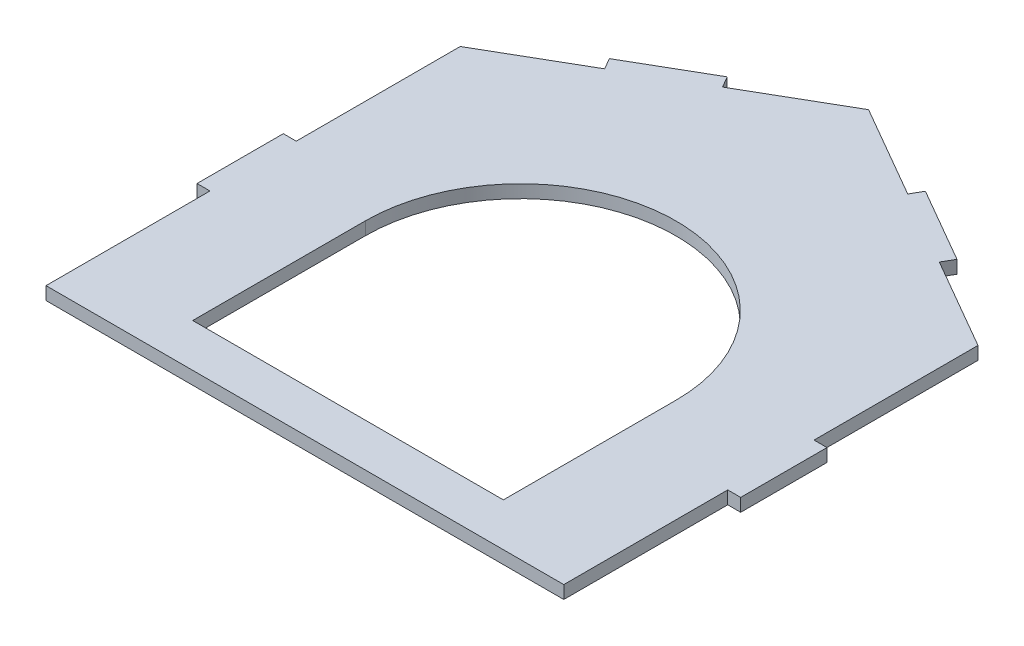
ISO-10303-21;
HEADER;
FILE_DESCRIPTION(('STEP AP214'),'2;1');
FILE_NAME('part.step','',(''),(''),'','','');
FILE_SCHEMA(('AUTOMOTIVE_DESIGN { 1 0 10303 214 1 1 1 1 }'));
ENDSEC;
DATA;
#1=APPLICATION_CONTEXT('core data for automotive mechanical design processes');
#2=APPLICATION_PROTOCOL_DEFINITION('international standard','automotive_design',2000,#1);
#3=PRODUCT_CONTEXT('',#1,'mechanical');
#4=PRODUCT('Part','Part','',(#3));
#5=PRODUCT_RELATED_PRODUCT_CATEGORY('part','',(#4));
#6=PRODUCT_DEFINITION_FORMATION('','',#4);
#7=PRODUCT_DEFINITION_CONTEXT('part definition',#1,'design');
#8=PRODUCT_DEFINITION('design','',#6,#7);
#9=PRODUCT_DEFINITION_SHAPE('','',#8);
#10=(LENGTH_UNIT() NAMED_UNIT(*) SI_UNIT(.MILLI.,.METRE.));
#11=(NAMED_UNIT(*) PLANE_ANGLE_UNIT() SI_UNIT($,.RADIAN.));
#12=(NAMED_UNIT(*) SI_UNIT($,.STERADIAN.) SOLID_ANGLE_UNIT());
#13=UNCERTAINTY_MEASURE_WITH_UNIT(LENGTH_MEASURE(1.E-05),#10,'distance_accuracy_value','');
#14=(GEOMETRIC_REPRESENTATION_CONTEXT(3) GLOBAL_UNCERTAINTY_ASSIGNED_CONTEXT((#13)) GLOBAL_UNIT_ASSIGNED_CONTEXT((#10,
#11,#12)) REPRESENTATION_CONTEXT('',''));
#15=CARTESIAN_POINT('',(0.,0.,0.));
#16=DIRECTION('',(0.,0.,1.));
#17=DIRECTION('',(1.,0.,0.));
#18=AXIS2_PLACEMENT_3D('',#15,#16,#17);
#19=CARTESIAN_POINT('',(193.911888036406,15.,-301.25));
#20=DIRECTION('',(-0.5,0.,0.866025403784439));
#21=DIRECTION('',(0.866025403784439,0.,0.5));
#22=AXIS2_PLACEMENT_3D('',#19,#20,#21);
#23=PLANE('',#22);
#24=DIRECTION('',(-0.866025403784439,0.,-0.5));
#25=VECTOR('',#24,1.);
#26=CARTESIAN_POINT('',(193.911888036406,0.,-301.25));
#27=LINE('',#26,#25);
#28=CARTESIAN_POINT('',(300.,0.,-240.));
#29=VERTEX_POINT('',#28);
#30=CARTESIAN_POINT('',(193.911888036406,0.,-301.25));
#31=VERTEX_POINT('',#30);
#32=EDGE_CURVE('E205',#29,#31,#27,.T.);
#33=ORIENTED_EDGE('',*,*,#32,.T.);
#34=DIRECTION('',(0.,-1.,0.));
#35=VECTOR('',#34,1.);
#36=CARTESIAN_POINT('',(193.911888036406,15.,-301.25));
#37=LINE('',#36,#35);
#38=CARTESIAN_POINT('',(193.911888036406,15.,-301.25));
#39=VERTEX_POINT('',#38);
#40=EDGE_CURVE('E11',#39,#31,#37,.T.);
#41=ORIENTED_EDGE('',*,*,#40,.F.);
#42=DIRECTION('',(-0.866025403784439,0.,-0.5));
#43=VECTOR('',#42,1.);
#44=CARTESIAN_POINT('',(193.911888036406,15.,-301.25));
#45=LINE('',#44,#43);
#46=CARTESIAN_POINT('',(300.,15.,-240.));
#47=VERTEX_POINT('',#46);
#48=EDGE_CURVE('E234',#47,#39,#45,.T.);
#49=ORIENTED_EDGE('',*,*,#48,.F.);
#50=DIRECTION('',(0.,-1.,0.));
#51=VECTOR('',#50,1.);
#52=CARTESIAN_POINT('',(300.,15.,-240.));
#53=LINE('',#52,#51);
#54=EDGE_CURVE('E278',#47,#29,#53,.T.);
#55=ORIENTED_EDGE('',*,*,#54,.T.);
#56=EDGE_LOOP('',(#33,#41,#49,#55));
#57=FACE_BOUND('',#56,.T.);
#58=ADVANCED_FACE('F33',(#57),#23,.F.);
#59=CARTESIAN_POINT('',(193.911888036406,15.,-301.25));
#60=DIRECTION('',(-0.866025403784439,0.,-0.5));
#61=DIRECTION('',(-0.5,0.,0.866025403784439));
#62=AXIS2_PLACEMENT_3D('',#59,#60,#61);
#63=PLANE('',#62);
#64=DIRECTION('',(0.5,0.,-0.866025403784439));
#65=VECTOR('',#64,1.);
#66=CARTESIAN_POINT('',(193.911888036406,0.,-301.25));
#67=LINE('',#66,#65);
#68=CARTESIAN_POINT('',(201.411888036406,0.,-314.240381056767));
#69=VERTEX_POINT('',#68);
#70=EDGE_CURVE('E281',#31,#69,#67,.T.);
#71=ORIENTED_EDGE('',*,*,#70,.T.);
#72=DIRECTION('',(0.,-1.,0.));
#73=VECTOR('',#72,1.);
#74=CARTESIAN_POINT('',(201.411888036406,15.,-314.240381056767));
#75=LINE('',#74,#73);
#76=CARTESIAN_POINT('',(201.411888036406,15.,-314.240381056767));
#77=VERTEX_POINT('',#76);
#78=EDGE_CURVE('E40',#77,#69,#75,.T.);
#79=ORIENTED_EDGE('',*,*,#78,.F.);
#80=DIRECTION('',(0.5,0.,-0.866025403784439));
#81=VECTOR('',#80,1.);
#82=CARTESIAN_POINT('',(193.911888036406,15.,-301.25));
#83=LINE('',#82,#81);
#84=EDGE_CURVE('E237',#39,#77,#83,.T.);
#85=ORIENTED_EDGE('',*,*,#84,.F.);
#86=ORIENTED_EDGE('',*,*,#40,.T.);
#87=EDGE_LOOP('',(#71,#79,#85,#86));
#88=FACE_BOUND('',#87,.T.);
#89=ADVANCED_FACE('F401',(#88),#63,.F.);
#90=CARTESIAN_POINT('',(201.411888036406,15.,-314.240381056767));
#91=DIRECTION('',(-0.500000000000003,0.,0.866025403784437));
#92=DIRECTION('',(0.866025403784437,0.,0.500000000000003));
#93=AXIS2_PLACEMENT_3D('',#90,#91,#92);
#94=PLANE('',#93);
#95=DIRECTION('',(-0.866025403784437,0.,-0.500000000000003));
#96=VECTOR('',#95,1.);
#97=CARTESIAN_POINT('',(201.411888036406,0.,-314.240381056767));
#98=LINE('',#97,#96);
#99=CARTESIAN_POINT('',(114.809347657962,0.,-364.240381056767));
#100=VERTEX_POINT('',#99);
#101=EDGE_CURVE('E283',#69,#100,#98,.T.);
#102=ORIENTED_EDGE('',*,*,#101,.T.);
#103=DIRECTION('',(0.,-1.,0.));
#104=VECTOR('',#103,1.);
#105=CARTESIAN_POINT('',(114.809347657962,15.,-364.240381056767));
#106=LINE('',#105,#104);
#107=CARTESIAN_POINT('',(114.809347657962,15.,-364.240381056767));
#108=VERTEX_POINT('',#107);
#109=EDGE_CURVE('E373',#108,#100,#106,.T.);
#110=ORIENTED_EDGE('',*,*,#109,.F.);
#111=DIRECTION('',(-0.866025403784437,0.,-0.500000000000003));
#112=VECTOR('',#111,1.);
#113=CARTESIAN_POINT('',(201.411888036406,15.,-314.240381056767));
#114=LINE('',#113,#112);
#115=EDGE_CURVE('E240',#77,#108,#114,.T.);
#116=ORIENTED_EDGE('',*,*,#115,.F.);
#117=ORIENTED_EDGE('',*,*,#78,.T.);
#118=EDGE_LOOP('',(#102,#110,#116,#117));
#119=FACE_BOUND('',#118,.T.);
#120=ADVANCED_FACE('F380',(#119),#94,.F.);
#121=CARTESIAN_POINT('',(114.809347657962,15.,-364.240381056767));
#122=DIRECTION('',(0.866025403784441,0.,0.499999999999995));
#123=DIRECTION('',(0.499999999999995,0.,-0.866025403784441));
#124=AXIS2_PLACEMENT_3D('',#121,#122,#123);
#125=PLANE('',#124);
#126=DIRECTION('',(-0.499999999999995,0.,0.866025403784441));
#127=VECTOR('',#126,1.);
#128=CARTESIAN_POINT('',(114.809347657962,0.,-364.240381056767));
#129=LINE('',#128,#127);
#130=CARTESIAN_POINT('',(107.309347657962,0.,-351.25));
#131=VERTEX_POINT('',#130);
#132=EDGE_CURVE('E285',#100,#131,#129,.T.);
#133=ORIENTED_EDGE('',*,*,#132,.T.);
#134=DIRECTION('',(0.,-1.,0.));
#135=VECTOR('',#134,1.);
#136=CARTESIAN_POINT('',(107.309347657962,15.,-351.25));
#137=LINE('',#136,#135);
#138=CARTESIAN_POINT('',(107.309347657962,15.,-351.25));
#139=VERTEX_POINT('',#138);
#140=EDGE_CURVE('E370',#139,#131,#137,.T.);
#141=ORIENTED_EDGE('',*,*,#140,.F.);
#142=DIRECTION('',(-0.499999999999995,0.,0.866025403784441));
#143=VECTOR('',#142,1.);
#144=CARTESIAN_POINT('',(114.809347657962,15.,-364.240381056767));
#145=LINE('',#144,#143);
#146=EDGE_CURVE('E242',#108,#139,#145,.T.);
#147=ORIENTED_EDGE('',*,*,#146,.F.);
#148=ORIENTED_EDGE('',*,*,#109,.T.);
#149=EDGE_LOOP('',(#133,#141,#147,#148));
#150=FACE_BOUND('',#149,.T.);
#151=ADVANCED_FACE('F389',(#150),#125,.F.);
#152=CARTESIAN_POINT('',(0.,15.,-413.205080756888));
#153=DIRECTION('',(-0.500000000000003,0.,0.866025403784437));
#154=DIRECTION('',(0.866025403784437,0.,0.500000000000003));
#155=AXIS2_PLACEMENT_3D('',#152,#153,#154);
#156=PLANE('',#155);
#157=DIRECTION('',(-0.866025403784437,0.,-0.500000000000003));
#158=VECTOR('',#157,1.);
#159=CARTESIAN_POINT('',(0.,0.,-413.205080756888));
#160=LINE('',#159,#158);
#161=CARTESIAN_POINT('',(0.,0.,-413.205080756888));
#162=VERTEX_POINT('',#161);
#163=EDGE_CURVE('E287',#131,#162,#160,.T.);
#164=ORIENTED_EDGE('',*,*,#163,.T.);
#165=DIRECTION('',(0.,-1.,0.));
#166=VECTOR('',#165,1.);
#167=CARTESIAN_POINT('',(0.,15.,-413.205080756888));
#168=LINE('',#167,#166);
#169=CARTESIAN_POINT('',(0.,15.,-413.205080756888));
#170=VERTEX_POINT('',#169);
#171=EDGE_CURVE('E367',#170,#162,#168,.T.);
#172=ORIENTED_EDGE('',*,*,#171,.F.);
#173=DIRECTION('',(-0.866025403784437,0.,-0.500000000000003));
#174=VECTOR('',#173,1.);
#175=CARTESIAN_POINT('',(0.,15.,-413.205080756888));
#176=LINE('',#175,#174);
#177=EDGE_CURVE('E244',#139,#170,#176,.T.);
#178=ORIENTED_EDGE('',*,*,#177,.F.);
#179=ORIENTED_EDGE('',*,*,#140,.T.);
#180=EDGE_LOOP('',(#164,#172,#178,#179));
#181=FACE_BOUND('',#180,.T.);
#182=ADVANCED_FACE('F393',(#181),#156,.F.);
#183=CARTESIAN_POINT('',(-107.309347657962,15.,-351.25));
#184=DIRECTION('',(0.500000000000003,0.,0.866025403784437));
#185=DIRECTION('',(0.866025403784437,0.,-0.500000000000003));
#186=AXIS2_PLACEMENT_3D('',#183,#184,#185);
#187=PLANE('',#186);
#188=DIRECTION('',(-0.866025403784437,0.,0.500000000000003));
#189=VECTOR('',#188,1.);
#190=CARTESIAN_POINT('',(-107.309347657962,0.,-351.25));
#191=LINE('',#190,#189);
#192=CARTESIAN_POINT('',(-107.309347657962,0.,-351.25));
#193=VERTEX_POINT('',#192);
#194=EDGE_CURVE('E289',#162,#193,#191,.T.);
#195=ORIENTED_EDGE('',*,*,#194,.T.);
#196=DIRECTION('',(0.,-1.,0.));
#197=VECTOR('',#196,1.);
#198=CARTESIAN_POINT('',(-107.309347657962,15.,-351.25));
#199=LINE('',#198,#197);
#200=CARTESIAN_POINT('',(-107.309347657962,15.,-351.25));
#201=VERTEX_POINT('',#200);
#202=EDGE_CURVE('E364',#201,#193,#199,.T.);
#203=ORIENTED_EDGE('',*,*,#202,.F.);
#204=DIRECTION('',(-0.866025403784437,0.,0.500000000000003));
#205=VECTOR('',#204,1.);
#206=CARTESIAN_POINT('',(-107.309347657962,15.,-351.25));
#207=LINE('',#206,#205);
#208=EDGE_CURVE('E246',#170,#201,#207,.T.);
#209=ORIENTED_EDGE('',*,*,#208,.F.);
#210=ORIENTED_EDGE('',*,*,#171,.T.);
#211=EDGE_LOOP('',(#195,#203,#209,#210));
#212=FACE_BOUND('',#211,.T.);
#213=ADVANCED_FACE('F479',(#212),#187,.F.);
#214=CARTESIAN_POINT('',(-114.809347657962,15.,-364.240381056767));
#215=DIRECTION('',(-0.866025403784441,0.,0.499999999999997));
#216=DIRECTION('',(0.499999999999997,0.,0.866025403784441));
#217=AXIS2_PLACEMENT_3D('',#214,#215,#216);
#218=PLANE('',#217);
#219=DIRECTION('',(-0.499999999999997,0.,-0.86602540378444));
#220=VECTOR('',#219,1.);
#221=CARTESIAN_POINT('',(-114.809347657962,0.,-364.240381056767));
#222=LINE('',#221,#220);
#223=CARTESIAN_POINT('',(-114.809347657962,0.,-364.240381056767));
#224=VERTEX_POINT('',#223);
#225=EDGE_CURVE('E291',#193,#224,#222,.T.);
#226=ORIENTED_EDGE('',*,*,#225,.T.);
#227=DIRECTION('',(0.,-1.,0.));
#228=VECTOR('',#227,1.);
#229=CARTESIAN_POINT('',(-114.809347657962,15.,-364.240381056767));
#230=LINE('',#229,#228);
#231=CARTESIAN_POINT('',(-114.809347657962,15.,-364.240381056767));
#232=VERTEX_POINT('',#231);
#233=EDGE_CURVE('E361',#232,#224,#230,.T.);
#234=ORIENTED_EDGE('',*,*,#233,.F.);
#235=DIRECTION('',(-0.499999999999997,0.,-0.86602540378444));
#236=VECTOR('',#235,1.);
#237=CARTESIAN_POINT('',(-114.809347657962,15.,-364.240381056767));
#238=LINE('',#237,#236);
#239=EDGE_CURVE('E248',#201,#232,#238,.T.);
#240=ORIENTED_EDGE('',*,*,#239,.F.);
#241=ORIENTED_EDGE('',*,*,#202,.T.);
#242=EDGE_LOOP('',(#226,#234,#240,#241));
#243=FACE_BOUND('',#242,.T.);
#244=ADVANCED_FACE('F477',(#243),#218,.F.);
#245=CARTESIAN_POINT('',(-201.411888036406,15.,-314.240381056766));
#246=DIRECTION('',(0.500000000000003,0.,0.866025403784437));
#247=DIRECTION('',(0.866025403784437,0.,-0.500000000000003));
#248=AXIS2_PLACEMENT_3D('',#245,#246,#247);
#249=PLANE('',#248);
#250=DIRECTION('',(-0.866025403784437,0.,0.500000000000003));
#251=VECTOR('',#250,1.);
#252=CARTESIAN_POINT('',(-201.411888036406,0.,-314.240381056766));
#253=LINE('',#252,#251);
#254=CARTESIAN_POINT('',(-201.411888036406,0.,-314.240381056766));
#255=VERTEX_POINT('',#254);
#256=EDGE_CURVE('E293',#224,#255,#253,.T.);
#257=ORIENTED_EDGE('',*,*,#256,.T.);
#258=DIRECTION('',(0.,-1.,0.));
#259=VECTOR('',#258,1.);
#260=CARTESIAN_POINT('',(-201.411888036406,15.,-314.240381056766));
#261=LINE('',#260,#259);
#262=CARTESIAN_POINT('',(-201.411888036406,15.,-314.240381056766));
#263=VERTEX_POINT('',#262);
#264=EDGE_CURVE('E358',#263,#255,#261,.T.);
#265=ORIENTED_EDGE('',*,*,#264,.F.);
#266=DIRECTION('',(-0.866025403784437,0.,0.500000000000003));
#267=VECTOR('',#266,1.);
#268=CARTESIAN_POINT('',(-201.411888036406,15.,-314.240381056766));
#269=LINE('',#268,#267);
#270=EDGE_CURVE('E250',#232,#263,#269,.T.);
#271=ORIENTED_EDGE('',*,*,#270,.F.);
#272=ORIENTED_EDGE('',*,*,#233,.T.);
#273=EDGE_LOOP('',(#257,#265,#271,#272));
#274=FACE_BOUND('',#273,.T.);
#275=ADVANCED_FACE('F473',(#274),#249,.F.);
#276=CARTESIAN_POINT('',(-193.911888036406,15.,-301.25));
#277=DIRECTION('',(0.866025403784438,0.,-0.500000000000002));
#278=DIRECTION('',(-0.500000000000002,0.,-0.866025403784438));
#279=AXIS2_PLACEMENT_3D('',#276,#277,#278);
#280=PLANE('',#279);
#281=DIRECTION('',(0.500000000000002,0.,0.866025403784438));
#282=VECTOR('',#281,1.);
#283=CARTESIAN_POINT('',(-193.911888036406,0.,-301.25));
#284=LINE('',#283,#282);
#285=CARTESIAN_POINT('',(-193.911888036406,0.,-301.25));
#286=VERTEX_POINT('',#285);
#287=EDGE_CURVE('E295',#255,#286,#284,.T.);
#288=ORIENTED_EDGE('',*,*,#287,.T.);
#289=DIRECTION('',(0.,-1.,0.));
#290=VECTOR('',#289,1.);
#291=CARTESIAN_POINT('',(-193.911888036406,15.,-301.25));
#292=LINE('',#291,#290);
#293=CARTESIAN_POINT('',(-193.911888036406,15.,-301.25));
#294=VERTEX_POINT('',#293);
#295=EDGE_CURVE('E355',#294,#286,#292,.T.);
#296=ORIENTED_EDGE('',*,*,#295,.F.);
#297=DIRECTION('',(0.500000000000002,0.,0.866025403784438));
#298=VECTOR('',#297,1.);
#299=CARTESIAN_POINT('',(-193.911888036406,15.,-301.25));
#300=LINE('',#299,#298);
#301=EDGE_CURVE('E252',#263,#294,#300,.T.);
#302=ORIENTED_EDGE('',*,*,#301,.F.);
#303=ORIENTED_EDGE('',*,*,#264,.T.);
#304=EDGE_LOOP('',(#288,#296,#302,#303));
#305=FACE_BOUND('',#304,.T.);
#306=ADVANCED_FACE('F468',(#305),#280,.F.);
#307=CARTESIAN_POINT('',(-300.,15.,-240.));
#308=DIRECTION('',(0.5,0.,0.866025403784438));
#309=DIRECTION('',(0.866025403784439,0.,-0.5));
#310=AXIS2_PLACEMENT_3D('',#307,#308,#309);
#311=PLANE('',#310);
#312=DIRECTION('',(-0.866025403784439,0.,0.5));
#313=VECTOR('',#312,1.);
#314=CARTESIAN_POINT('',(-300.,0.,-240.));
#315=LINE('',#314,#313);
#316=CARTESIAN_POINT('',(-300.,0.,-240.));
#317=VERTEX_POINT('',#316);
#318=EDGE_CURVE('E297',#286,#317,#315,.T.);
#319=ORIENTED_EDGE('',*,*,#318,.T.);
#320=DIRECTION('',(0.,-1.,0.));
#321=VECTOR('',#320,1.);
#322=CARTESIAN_POINT('',(-300.,15.,-240.));
#323=LINE('',#322,#321);
#324=CARTESIAN_POINT('',(-300.,15.,-240.));
#325=VERTEX_POINT('',#324);
#326=EDGE_CURVE('E352',#325,#317,#323,.T.);
#327=ORIENTED_EDGE('',*,*,#326,.F.);
#328=DIRECTION('',(-0.866025403784439,0.,0.5));
#329=VECTOR('',#328,1.);
#330=CARTESIAN_POINT('',(-300.,15.,-240.));
#331=LINE('',#330,#329);
#332=EDGE_CURVE('E254',#294,#325,#331,.T.);
#333=ORIENTED_EDGE('',*,*,#332,.F.);
#334=ORIENTED_EDGE('',*,*,#295,.T.);
#335=EDGE_LOOP('',(#319,#327,#333,#334));
#336=FACE_BOUND('',#335,.T.);
#337=ADVANCED_FACE('F462',(#336),#311,.F.);
#338=CARTESIAN_POINT('',(-300.,15.,-50.));
#339=DIRECTION('',(1.,0.,0.));
#340=DIRECTION('',(0.,0.,-1.));
#341=AXIS2_PLACEMENT_3D('',#338,#339,#340);
#342=PLANE('',#341);
#343=DIRECTION('',(0.,0.,1.));
#344=VECTOR('',#343,1.);
#345=CARTESIAN_POINT('',(-300.,0.,-50.));
#346=LINE('',#345,#344);
#347=CARTESIAN_POINT('',(-300.,0.,-50.));
#348=VERTEX_POINT('',#347);
#349=EDGE_CURVE('E299',#317,#348,#346,.T.);
#350=ORIENTED_EDGE('',*,*,#349,.T.);
#351=DIRECTION('',(0.,-1.,0.));
#352=VECTOR('',#351,1.);
#353=CARTESIAN_POINT('',(-300.,15.,-50.));
#354=LINE('',#353,#352);
#355=CARTESIAN_POINT('',(-300.,15.,-50.));
#356=VERTEX_POINT('',#355);
#357=EDGE_CURVE('E349',#356,#348,#354,.T.);
#358=ORIENTED_EDGE('',*,*,#357,.F.);
#359=DIRECTION('',(0.,0.,1.));
#360=VECTOR('',#359,1.);
#361=CARTESIAN_POINT('',(-300.,15.,-50.));
#362=LINE('',#361,#360);
#363=EDGE_CURVE('E256',#325,#356,#362,.T.);
#364=ORIENTED_EDGE('',*,*,#363,.F.);
#365=ORIENTED_EDGE('',*,*,#326,.T.);
#366=EDGE_LOOP('',(#350,#358,#364,#365));
#367=FACE_BOUND('',#366,.T.);
#368=ADVANCED_FACE('F458',(#367),#342,.F.);
#369=CARTESIAN_POINT('',(-300.,15.,-50.));
#370=DIRECTION('',(0.,0.,1.));
#371=DIRECTION('',(1.,0.,0.));
#372=AXIS2_PLACEMENT_3D('',#369,#370,#371);
#373=PLANE('',#372);
#374=DIRECTION('',(-1.,0.,0.));
#375=VECTOR('',#374,1.);
#376=CARTESIAN_POINT('',(-300.,0.,-50.));
#377=LINE('',#376,#375);
#378=CARTESIAN_POINT('',(-315.,0.,-50.));
#379=VERTEX_POINT('',#378);
#380=EDGE_CURVE('E301',#348,#379,#377,.T.);
#381=ORIENTED_EDGE('',*,*,#380,.T.);
#382=DIRECTION('',(0.,-1.,0.));
#383=VECTOR('',#382,1.);
#384=CARTESIAN_POINT('',(-315.,15.,-50.));
#385=LINE('',#384,#383);
#386=CARTESIAN_POINT('',(-315.,15.,-50.));
#387=VERTEX_POINT('',#386);
#388=EDGE_CURVE('E346',#387,#379,#385,.T.);
#389=ORIENTED_EDGE('',*,*,#388,.F.);
#390=DIRECTION('',(-1.,0.,0.));
#391=VECTOR('',#390,1.);
#392=CARTESIAN_POINT('',(-300.,15.,-50.));
#393=LINE('',#392,#391);
#394=EDGE_CURVE('E258',#356,#387,#393,.T.);
#395=ORIENTED_EDGE('',*,*,#394,.F.);
#396=ORIENTED_EDGE('',*,*,#357,.T.);
#397=EDGE_LOOP('',(#381,#389,#395,#396));
#398=FACE_BOUND('',#397,.T.);
#399=ADVANCED_FACE('F453',(#398),#373,.F.);
#400=CARTESIAN_POINT('',(-315.,15.,-50.));
#401=DIRECTION('',(1.,0.,0.));
#402=DIRECTION('',(0.,0.,-1.));
#403=AXIS2_PLACEMENT_3D('',#400,#401,#402);
#404=PLANE('',#403);
#405=DIRECTION('',(0.,0.,1.));
#406=VECTOR('',#405,1.);
#407=CARTESIAN_POINT('',(-315.,0.,-50.));
#408=LINE('',#407,#406);
#409=CARTESIAN_POINT('',(-315.,0.,50.));
#410=VERTEX_POINT('',#409);
#411=EDGE_CURVE('E303',#379,#410,#408,.T.);
#412=ORIENTED_EDGE('',*,*,#411,.T.);
#413=DIRECTION('',(0.,-1.,0.));
#414=VECTOR('',#413,1.);
#415=CARTESIAN_POINT('',(-315.,15.,50.));
#416=LINE('',#415,#414);
#417=CARTESIAN_POINT('',(-315.,15.,50.));
#418=VERTEX_POINT('',#417);
#419=EDGE_CURVE('E343',#418,#410,#416,.T.);
#420=ORIENTED_EDGE('',*,*,#419,.F.);
#421=DIRECTION('',(0.,0.,1.));
#422=VECTOR('',#421,1.);
#423=CARTESIAN_POINT('',(-315.,15.,-50.));
#424=LINE('',#423,#422);
#425=EDGE_CURVE('E260',#387,#418,#424,.T.);
#426=ORIENTED_EDGE('',*,*,#425,.F.);
#427=ORIENTED_EDGE('',*,*,#388,.T.);
#428=EDGE_LOOP('',(#412,#420,#426,#427));
#429=FACE_BOUND('',#428,.T.);
#430=ADVANCED_FACE('F447',(#429),#404,.F.);
#431=CARTESIAN_POINT('',(-315.,15.,50.));
#432=DIRECTION('',(0.,0.,-1.));
#433=DIRECTION('',(-1.,0.,0.));
#434=AXIS2_PLACEMENT_3D('',#431,#432,#433);
#435=PLANE('',#434);
#436=DIRECTION('',(1.,0.,0.));
#437=VECTOR('',#436,1.);
#438=CARTESIAN_POINT('',(-315.,0.,50.));
#439=LINE('',#438,#437);
#440=CARTESIAN_POINT('',(-300.,0.,50.));
#441=VERTEX_POINT('',#440);
#442=EDGE_CURVE('E305',#410,#441,#439,.T.);
#443=ORIENTED_EDGE('',*,*,#442,.T.);
#444=DIRECTION('',(0.,-1.,0.));
#445=VECTOR('',#444,1.);
#446=CARTESIAN_POINT('',(-300.,15.,50.));
#447=LINE('',#446,#445);
#448=CARTESIAN_POINT('',(-300.,15.,50.));
#449=VERTEX_POINT('',#448);
#450=EDGE_CURVE('E340',#449,#441,#447,.T.);
#451=ORIENTED_EDGE('',*,*,#450,.F.);
#452=DIRECTION('',(1.,0.,0.));
#453=VECTOR('',#452,1.);
#454=CARTESIAN_POINT('',(-315.,15.,50.));
#455=LINE('',#454,#453);
#456=EDGE_CURVE('E262',#418,#449,#455,.T.);
#457=ORIENTED_EDGE('',*,*,#456,.F.);
#458=ORIENTED_EDGE('',*,*,#419,.T.);
#459=EDGE_LOOP('',(#443,#451,#457,#458));
#460=FACE_BOUND('',#459,.T.);
#461=ADVANCED_FACE('F443',(#460),#435,.F.);
#462=CARTESIAN_POINT('',(-300.,15.,240.));
#463=DIRECTION('',(1.,0.,0.));
#464=DIRECTION('',(0.,0.,-1.));
#465=AXIS2_PLACEMENT_3D('',#462,#463,#464);
#466=PLANE('',#465);
#467=DIRECTION('',(0.,0.,1.));
#468=VECTOR('',#467,1.);
#469=CARTESIAN_POINT('',(-300.,0.,240.));
#470=LINE('',#469,#468);
#471=CARTESIAN_POINT('',(-300.,0.,240.));
#472=VERTEX_POINT('',#471);
#473=EDGE_CURVE('E307',#441,#472,#470,.T.);
#474=ORIENTED_EDGE('',*,*,#473,.T.);
#475=DIRECTION('',(0.,-1.,0.));
#476=VECTOR('',#475,1.);
#477=CARTESIAN_POINT('',(-300.,15.,240.));
#478=LINE('',#477,#476);
#479=CARTESIAN_POINT('',(-300.,15.,240.));
#480=VERTEX_POINT('',#479);
#481=EDGE_CURVE('E337',#480,#472,#478,.T.);
#482=ORIENTED_EDGE('',*,*,#481,.F.);
#483=DIRECTION('',(0.,0.,1.));
#484=VECTOR('',#483,1.);
#485=CARTESIAN_POINT('',(-300.,15.,240.));
#486=LINE('',#485,#484);
#487=EDGE_CURVE('E264',#449,#480,#486,.T.);
#488=ORIENTED_EDGE('',*,*,#487,.F.);
#489=ORIENTED_EDGE('',*,*,#450,.T.);
#490=EDGE_LOOP('',(#474,#482,#488,#489));
#491=FACE_BOUND('',#490,.T.);
#492=ADVANCED_FACE('F438',(#491),#466,.F.);
#493=CARTESIAN_POINT('',(-300.,15.,240.));
#494=DIRECTION('',(0.,0.,-1.));
#495=DIRECTION('',(-1.,0.,0.));
#496=AXIS2_PLACEMENT_3D('',#493,#494,#495);
#497=PLANE('',#496);
#498=DIRECTION('',(1.,0.,0.));
#499=VECTOR('',#498,1.);
#500=CARTESIAN_POINT('',(-300.,0.,240.));
#501=LINE('',#500,#499);
#502=CARTESIAN_POINT('',(300.,0.,240.));
#503=VERTEX_POINT('',#502);
#504=EDGE_CURVE('E309',#472,#503,#501,.T.);
#505=ORIENTED_EDGE('',*,*,#504,.T.);
#506=DIRECTION('',(0.,-1.,0.));
#507=VECTOR('',#506,1.);
#508=CARTESIAN_POINT('',(300.,15.,240.));
#509=LINE('',#508,#507);
#510=CARTESIAN_POINT('',(300.,15.,240.));
#511=VERTEX_POINT('',#510);
#512=EDGE_CURVE('E334',#511,#503,#509,.T.);
#513=ORIENTED_EDGE('',*,*,#512,.F.);
#514=DIRECTION('',(1.,0.,0.));
#515=VECTOR('',#514,1.);
#516=CARTESIAN_POINT('',(-300.,15.,240.));
#517=LINE('',#516,#515);
#518=EDGE_CURVE('E266',#480,#511,#517,.T.);
#519=ORIENTED_EDGE('',*,*,#518,.F.);
#520=ORIENTED_EDGE('',*,*,#481,.T.);
#521=EDGE_LOOP('',(#505,#513,#519,#520));
#522=FACE_BOUND('',#521,.T.);
#523=ADVANCED_FACE('F432',(#522),#497,.F.);
#524=CARTESIAN_POINT('',(300.,15.,50.));
#525=DIRECTION('',(-1.,0.,0.));
#526=DIRECTION('',(0.,0.,1.));
#527=AXIS2_PLACEMENT_3D('',#524,#525,#526);
#528=PLANE('',#527);
#529=DIRECTION('',(0.,0.,-1.));
#530=VECTOR('',#529,1.);
#531=CARTESIAN_POINT('',(300.,0.,50.));
#532=LINE('',#531,#530);
#533=CARTESIAN_POINT('',(300.,0.,50.));
#534=VERTEX_POINT('',#533);
#535=EDGE_CURVE('E311',#503,#534,#532,.T.);
#536=ORIENTED_EDGE('',*,*,#535,.T.);
#537=DIRECTION('',(0.,-1.,0.));
#538=VECTOR('',#537,1.);
#539=CARTESIAN_POINT('',(300.,15.,50.));
#540=LINE('',#539,#538);
#541=CARTESIAN_POINT('',(300.,15.,50.));
#542=VERTEX_POINT('',#541);
#543=EDGE_CURVE('E331',#542,#534,#540,.T.);
#544=ORIENTED_EDGE('',*,*,#543,.F.);
#545=DIRECTION('',(0.,0.,-1.));
#546=VECTOR('',#545,1.);
#547=CARTESIAN_POINT('',(300.,15.,50.));
#548=LINE('',#547,#546);
#549=EDGE_CURVE('E268',#511,#542,#548,.T.);
#550=ORIENTED_EDGE('',*,*,#549,.F.);
#551=ORIENTED_EDGE('',*,*,#512,.T.);
#552=EDGE_LOOP('',(#536,#544,#550,#551));
#553=FACE_BOUND('',#552,.T.);
#554=ADVANCED_FACE('F428',(#553),#528,.F.);
#555=CARTESIAN_POINT('',(315.,15.,50.));
#556=DIRECTION('',(0.,0.,-1.));
#557=DIRECTION('',(-1.,0.,0.));
#558=AXIS2_PLACEMENT_3D('',#555,#556,#557);
#559=PLANE('',#558);
#560=DIRECTION('',(1.,0.,0.));
#561=VECTOR('',#560,1.);
#562=CARTESIAN_POINT('',(315.,0.,50.));
#563=LINE('',#562,#561);
#564=CARTESIAN_POINT('',(315.,0.,50.));
#565=VERTEX_POINT('',#564);
#566=EDGE_CURVE('E313',#534,#565,#563,.T.);
#567=ORIENTED_EDGE('',*,*,#566,.T.);
#568=DIRECTION('',(0.,-1.,0.));
#569=VECTOR('',#568,1.);
#570=CARTESIAN_POINT('',(315.,15.,50.));
#571=LINE('',#570,#569);
#572=CARTESIAN_POINT('',(315.,15.,50.));
#573=VERTEX_POINT('',#572);
#574=EDGE_CURVE('E328',#573,#565,#571,.T.);
#575=ORIENTED_EDGE('',*,*,#574,.F.);
#576=DIRECTION('',(1.,0.,0.));
#577=VECTOR('',#576,1.);
#578=CARTESIAN_POINT('',(315.,15.,50.));
#579=LINE('',#578,#577);
#580=EDGE_CURVE('E270',#542,#573,#579,.T.);
#581=ORIENTED_EDGE('',*,*,#580,.F.);
#582=ORIENTED_EDGE('',*,*,#543,.T.);
#583=EDGE_LOOP('',(#567,#575,#581,#582));
#584=FACE_BOUND('',#583,.T.);
#585=ADVANCED_FACE('F423',(#584),#559,.F.);
#586=CARTESIAN_POINT('',(315.,15.,-50.));
#587=DIRECTION('',(-1.,0.,0.));
#588=DIRECTION('',(0.,0.,1.));
#589=AXIS2_PLACEMENT_3D('',#586,#587,#588);
#590=PLANE('',#589);
#591=DIRECTION('',(0.,0.,-1.));
#592=VECTOR('',#591,1.);
#593=CARTESIAN_POINT('',(315.,0.,-50.));
#594=LINE('',#593,#592);
#595=CARTESIAN_POINT('',(315.,0.,-50.));
#596=VERTEX_POINT('',#595);
#597=EDGE_CURVE('E315',#565,#596,#594,.T.);
#598=ORIENTED_EDGE('',*,*,#597,.T.);
#599=DIRECTION('',(0.,-1.,0.));
#600=VECTOR('',#599,1.);
#601=CARTESIAN_POINT('',(315.,15.,-50.));
#602=LINE('',#601,#600);
#603=CARTESIAN_POINT('',(315.,15.,-50.));
#604=VERTEX_POINT('',#603);
#605=EDGE_CURVE('E325',#604,#596,#602,.T.);
#606=ORIENTED_EDGE('',*,*,#605,.F.);
#607=DIRECTION('',(0.,0.,-1.));
#608=VECTOR('',#607,1.);
#609=CARTESIAN_POINT('',(315.,15.,-50.));
#610=LINE('',#609,#608);
#611=EDGE_CURVE('E272',#573,#604,#610,.T.);
#612=ORIENTED_EDGE('',*,*,#611,.F.);
#613=ORIENTED_EDGE('',*,*,#574,.T.);
#614=EDGE_LOOP('',(#598,#606,#612,#613));
#615=FACE_BOUND('',#614,.T.);
#616=ADVANCED_FACE('F417',(#615),#590,.F.);
#617=CARTESIAN_POINT('',(300.,15.,-50.));
#618=DIRECTION('',(0.,0.,1.));
#619=DIRECTION('',(1.,0.,0.));
#620=AXIS2_PLACEMENT_3D('',#617,#618,#619);
#621=PLANE('',#620);
#622=DIRECTION('',(-1.,0.,0.));
#623=VECTOR('',#622,1.);
#624=CARTESIAN_POINT('',(300.,0.,-50.));
#625=LINE('',#624,#623);
#626=CARTESIAN_POINT('',(300.,0.,-50.));
#627=VERTEX_POINT('',#626);
#628=EDGE_CURVE('E317',#596,#627,#625,.T.);
#629=ORIENTED_EDGE('',*,*,#628,.T.);
#630=DIRECTION('',(0.,-1.,0.));
#631=VECTOR('',#630,1.);
#632=CARTESIAN_POINT('',(300.,15.,-50.));
#633=LINE('',#632,#631);
#634=CARTESIAN_POINT('',(300.,15.,-50.));
#635=VERTEX_POINT('',#634);
#636=EDGE_CURVE('E322',#635,#627,#633,.T.);
#637=ORIENTED_EDGE('',*,*,#636,.F.);
#638=DIRECTION('',(-1.,0.,0.));
#639=VECTOR('',#638,1.);
#640=CARTESIAN_POINT('',(300.,15.,-50.));
#641=LINE('',#640,#639);
#642=EDGE_CURVE('E274',#604,#635,#641,.T.);
#643=ORIENTED_EDGE('',*,*,#642,.F.);
#644=ORIENTED_EDGE('',*,*,#605,.T.);
#645=EDGE_LOOP('',(#629,#637,#643,#644));
#646=FACE_BOUND('',#645,.T.);
#647=ADVANCED_FACE('F413',(#646),#621,.F.);
#648=CARTESIAN_POINT('',(300.,15.,-240.));
#649=DIRECTION('',(-1.,0.,0.));
#650=DIRECTION('',(0.,0.,1.));
#651=AXIS2_PLACEMENT_3D('',#648,#649,#650);
#652=PLANE('',#651);
#653=DIRECTION('',(0.,0.,-1.));
#654=VECTOR('',#653,1.);
#655=CARTESIAN_POINT('',(300.,0.,-240.));
#656=LINE('',#655,#654);
#657=EDGE_CURVE('E238',#627,#29,#656,.T.);
#658=ORIENTED_EDGE('',*,*,#657,.T.);
#659=ORIENTED_EDGE('',*,*,#54,.F.);
#660=DIRECTION('',(0.,0.,-1.));
#661=VECTOR('',#660,1.);
#662=CARTESIAN_POINT('',(300.,15.,-240.));
#663=LINE('',#662,#661);
#664=EDGE_CURVE('E276',#635,#47,#663,.T.);
#665=ORIENTED_EDGE('',*,*,#664,.F.);
#666=ORIENTED_EDGE('',*,*,#636,.T.);
#667=EDGE_LOOP('',(#658,#659,#665,#666));
#668=FACE_BOUND('',#667,.T.);
#669=ADVANCED_FACE('F408',(#668),#652,.F.);
#670=CARTESIAN_POINT('',(0.,15.,0.));
#671=DIRECTION('',(0.,-1.,0.));
#672=DIRECTION('',(0.,0.,-1.));
#673=AXIS2_PLACEMENT_3D('',#670,#671,#672);
#674=PLANE('',#673);
#675=CARTESIAN_POINT('',(0.,15.,-10.));
#676=DIRECTION('',(0.,1.,0.));
#677=DIRECTION('',(0.,0.,-1.));
#678=AXIS2_PLACEMENT_3D('',#675,#676,#677);
#679=CIRCLE('',#678,180.);
#680=CARTESIAN_POINT('',(180.,15.,-10.));
#681=VERTEX_POINT('',#680);
#682=CARTESIAN_POINT('',(-180.,15.,-9.99999999999999));
#683=VERTEX_POINT('',#682);
#684=EDGE_CURVE('E218',#681,#683,#679,.T.);
#685=ORIENTED_EDGE('',*,*,#684,.F.);
#686=DIRECTION('',(0.,0.,-1.));
#687=VECTOR('',#686,1.);
#688=CARTESIAN_POINT('',(180.,15.,190.));
#689=LINE('',#688,#687);
#690=CARTESIAN_POINT('',(180.,15.,190.));
#691=VERTEX_POINT('',#690);
#692=EDGE_CURVE('E47',#691,#681,#689,.T.);
#693=ORIENTED_EDGE('',*,*,#692,.F.);
#694=DIRECTION('',(1.,0.,0.));
#695=VECTOR('',#694,1.);
#696=CARTESIAN_POINT('',(-180.,15.,190.));
#697=LINE('',#696,#695);
#698=CARTESIAN_POINT('',(-180.,15.,190.));
#699=VERTEX_POINT('',#698);
#700=EDGE_CURVE('E211',#699,#691,#697,.T.);
#701=ORIENTED_EDGE('',*,*,#700,.F.);
#702=DIRECTION('',(0.,0.,1.));
#703=VECTOR('',#702,1.);
#704=CARTESIAN_POINT('',(-180.,15.,190.));
#705=LINE('',#704,#703);
#706=EDGE_CURVE('E225',#683,#699,#705,.T.);
#707=ORIENTED_EDGE('',*,*,#706,.F.);
#708=EDGE_LOOP('',(#685,#693,#701,#707));
#709=FACE_BOUND('',#708,.T.);
#710=ORIENTED_EDGE('',*,*,#48,.T.);
#711=ORIENTED_EDGE('',*,*,#84,.T.);
#712=ORIENTED_EDGE('',*,*,#115,.T.);
#713=ORIENTED_EDGE('',*,*,#146,.T.);
#714=ORIENTED_EDGE('',*,*,#177,.T.);
#715=ORIENTED_EDGE('',*,*,#208,.T.);
#716=ORIENTED_EDGE('',*,*,#239,.T.);
#717=ORIENTED_EDGE('',*,*,#270,.T.);
#718=ORIENTED_EDGE('',*,*,#301,.T.);
#719=ORIENTED_EDGE('',*,*,#332,.T.);
#720=ORIENTED_EDGE('',*,*,#363,.T.);
#721=ORIENTED_EDGE('',*,*,#394,.T.);
#722=ORIENTED_EDGE('',*,*,#425,.T.);
#723=ORIENTED_EDGE('',*,*,#456,.T.);
#724=ORIENTED_EDGE('',*,*,#487,.T.);
#725=ORIENTED_EDGE('',*,*,#518,.T.);
#726=ORIENTED_EDGE('',*,*,#549,.T.);
#727=ORIENTED_EDGE('',*,*,#580,.T.);
#728=ORIENTED_EDGE('',*,*,#611,.T.);
#729=ORIENTED_EDGE('',*,*,#642,.T.);
#730=ORIENTED_EDGE('',*,*,#664,.T.);
#731=EDGE_LOOP('',(#710,#711,#712,#713,#714,#715,#716,#717,#718,#719,#720,#721,#722,#723,#724,
#725,#726,#727,#728,#729,#730));
#732=FACE_BOUND('',#731,.T.);
#733=ADVANCED_FACE('F397',(#709,#732),#674,.F.);
#734=CARTESIAN_POINT('',(0.,0.,0.));
#735=DIRECTION('',(0.,-1.,0.));
#736=DIRECTION('',(0.,0.,-1.));
#737=AXIS2_PLACEMENT_3D('',#734,#735,#736);
#738=PLANE('',#737);
#739=DIRECTION('',(0.,0.,-1.));
#740=VECTOR('',#739,1.);
#741=CARTESIAN_POINT('',(180.,0.,190.));
#742=LINE('',#741,#740);
#743=CARTESIAN_POINT('',(180.,0.,190.));
#744=VERTEX_POINT('',#743);
#745=CARTESIAN_POINT('',(180.,0.,-10.));
#746=VERTEX_POINT('',#745);
#747=EDGE_CURVE('E209',#744,#746,#742,.T.);
#748=ORIENTED_EDGE('',*,*,#747,.T.);
#749=CARTESIAN_POINT('',(0.,0.,-10.));
#750=DIRECTION('',(0.,-1.,0.));
#751=DIRECTION('',(0.,0.,-1.));
#752=AXIS2_PLACEMENT_3D('',#749,#750,#751);
#753=CIRCLE('',#752,180.);
#754=CARTESIAN_POINT('',(-180.,0.,-9.99999999999999));
#755=VERTEX_POINT('',#754);
#756=EDGE_CURVE('E198',#746,#755,#753,.F.);
#757=ORIENTED_EDGE('',*,*,#756,.T.);
#758=DIRECTION('',(0.,0.,1.));
#759=VECTOR('',#758,1.);
#760=CARTESIAN_POINT('',(-180.,0.,190.));
#761=LINE('',#760,#759);
#762=CARTESIAN_POINT('',(-180.,0.,190.));
#763=VERTEX_POINT('',#762);
#764=EDGE_CURVE('E220',#755,#763,#761,.T.);
#765=ORIENTED_EDGE('',*,*,#764,.T.);
#766=DIRECTION('',(1.,0.,0.));
#767=VECTOR('',#766,1.);
#768=CARTESIAN_POINT('',(-180.,0.,190.));
#769=LINE('',#768,#767);
#770=EDGE_CURVE('E216',#763,#744,#769,.T.);
#771=ORIENTED_EDGE('',*,*,#770,.T.);
#772=EDGE_LOOP('',(#748,#757,#765,#771));
#773=FACE_BOUND('',#772,.T.);
#774=ORIENTED_EDGE('',*,*,#32,.F.);
#775=ORIENTED_EDGE('',*,*,#657,.F.);
#776=ORIENTED_EDGE('',*,*,#628,.F.);
#777=ORIENTED_EDGE('',*,*,#597,.F.);
#778=ORIENTED_EDGE('',*,*,#566,.F.);
#779=ORIENTED_EDGE('',*,*,#535,.F.);
#780=ORIENTED_EDGE('',*,*,#504,.F.);
#781=ORIENTED_EDGE('',*,*,#473,.F.);
#782=ORIENTED_EDGE('',*,*,#442,.F.);
#783=ORIENTED_EDGE('',*,*,#411,.F.);
#784=ORIENTED_EDGE('',*,*,#380,.F.);
#785=ORIENTED_EDGE('',*,*,#349,.F.);
#786=ORIENTED_EDGE('',*,*,#318,.F.);
#787=ORIENTED_EDGE('',*,*,#287,.F.);
#788=ORIENTED_EDGE('',*,*,#256,.F.);
#789=ORIENTED_EDGE('',*,*,#225,.F.);
#790=ORIENTED_EDGE('',*,*,#194,.F.);
#791=ORIENTED_EDGE('',*,*,#163,.F.);
#792=ORIENTED_EDGE('',*,*,#132,.F.);
#793=ORIENTED_EDGE('',*,*,#101,.F.);
#794=ORIENTED_EDGE('',*,*,#70,.F.);
#795=EDGE_LOOP('',(#774,#775,#776,#777,#778,#779,#780,#781,#782,#783,#784,#785,#786,#787,#788,
#789,#790,#791,#792,#793,#794));
#796=FACE_BOUND('',#795,.T.);
#797=ADVANCED_FACE('F214',(#773,#796),#738,.T.);
#798=CARTESIAN_POINT('',(180.,-0.000999999999999265,190.));
#799=DIRECTION('',(1.,0.,0.));
#800=DIRECTION('',(0.,0.,-1.));
#801=AXIS2_PLACEMENT_3D('',#798,#799,#800);
#802=PLANE('',#801);
#803=DIRECTION('',(0.,1.,0.));
#804=VECTOR('',#803,1.);
#805=CARTESIAN_POINT('',(180.,-0.000999999999999265,190.));
#806=LINE('',#805,#804);
#807=EDGE_CURVE('E206',#744,#691,#806,.T.);
#808=ORIENTED_EDGE('',*,*,#807,.T.);
#809=ORIENTED_EDGE('',*,*,#692,.T.);
#810=DIRECTION('',(0.,1.,0.));
#811=VECTOR('',#810,1.);
#812=CARTESIAN_POINT('',(180.,-0.000999999999999265,-10.));
#813=LINE('',#812,#811);
#814=EDGE_CURVE('E200',#746,#681,#813,.T.);
#815=ORIENTED_EDGE('',*,*,#814,.F.);
#816=ORIENTED_EDGE('',*,*,#747,.F.);
#817=EDGE_LOOP('',(#808,#809,#815,#816));
#818=FACE_BOUND('',#817,.T.);
#819=ADVANCED_FACE('F208',(#818),#802,.F.);
#820=CARTESIAN_POINT('',(-180.,-0.000999999999999265,190.));
#821=DIRECTION('',(0.,0.,1.));
#822=DIRECTION('',(1.,0.,0.));
#823=AXIS2_PLACEMENT_3D('',#820,#821,#822);
#824=PLANE('',#823);
#825=DIRECTION('',(0.,1.,0.));
#826=VECTOR('',#825,1.);
#827=CARTESIAN_POINT('',(-180.,-0.000999999999999265,190.));
#828=LINE('',#827,#826);
#829=EDGE_CURVE('E231',#763,#699,#828,.T.);
#830=ORIENTED_EDGE('',*,*,#829,.T.);
#831=ORIENTED_EDGE('',*,*,#700,.T.);
#832=ORIENTED_EDGE('',*,*,#807,.F.);
#833=ORIENTED_EDGE('',*,*,#770,.F.);
#834=EDGE_LOOP('',(#830,#831,#832,#833));
#835=FACE_BOUND('',#834,.T.);
#836=ADVANCED_FACE('F654',(#835),#824,.F.);
#837=CARTESIAN_POINT('',(-180.,-0.000999999999999265,190.));
#838=DIRECTION('',(-1.,0.,0.));
#839=DIRECTION('',(0.,0.,1.));
#840=AXIS2_PLACEMENT_3D('',#837,#838,#839);
#841=PLANE('',#840);
#842=DIRECTION('',(0.,1.,0.));
#843=VECTOR('',#842,1.);
#844=CARTESIAN_POINT('',(-180.,-0.000999999999999265,-9.99999999999999));
#845=LINE('',#844,#843);
#846=EDGE_CURVE('E55',#755,#683,#845,.T.);
#847=ORIENTED_EDGE('',*,*,#846,.T.);
#848=ORIENTED_EDGE('',*,*,#706,.T.);
#849=ORIENTED_EDGE('',*,*,#829,.F.);
#850=ORIENTED_EDGE('',*,*,#764,.F.);
#851=EDGE_LOOP('',(#847,#848,#849,#850));
#852=FACE_BOUND('',#851,.T.);
#853=ADVANCED_FACE('F663',(#852),#841,.F.);
#854=CARTESIAN_POINT('',(0.,-0.000999999999999265,-10.));
#855=DIRECTION('',(0.,1.,0.));
#856=DIRECTION('',(0.,0.,1.));
#857=AXIS2_PLACEMENT_3D('',#854,#855,#856);
#858=CYLINDRICAL_SURFACE('',#857,180.);
#859=ORIENTED_EDGE('',*,*,#814,.T.);
#860=ORIENTED_EDGE('',*,*,#684,.T.);
#861=ORIENTED_EDGE('',*,*,#846,.F.);
#862=ORIENTED_EDGE('',*,*,#756,.F.);
#863=EDGE_LOOP('',(#859,#860,#861,#862));
#864=FACE_BOUND('',#863,.T.);
#865=ADVANCED_FACE('F199',(#864),#858,.F.);
#866=CLOSED_SHELL('',(#58,#89,#120,#151,#182,#213,#244,#275,#306,#337,#368,#399,#430,#461,#492,
#523,#554,#585,#616,#647,#669,#733,#797,#819,#836,#853,#865));
#867=MANIFOLD_SOLID_BREP('B2',#866);
#868=ADVANCED_BREP_SHAPE_REPRESENTATION('',(#18,#867),#14);
#869=SHAPE_DEFINITION_REPRESENTATION(#9,#868);
ENDSEC;
END-ISO-10303-21;
